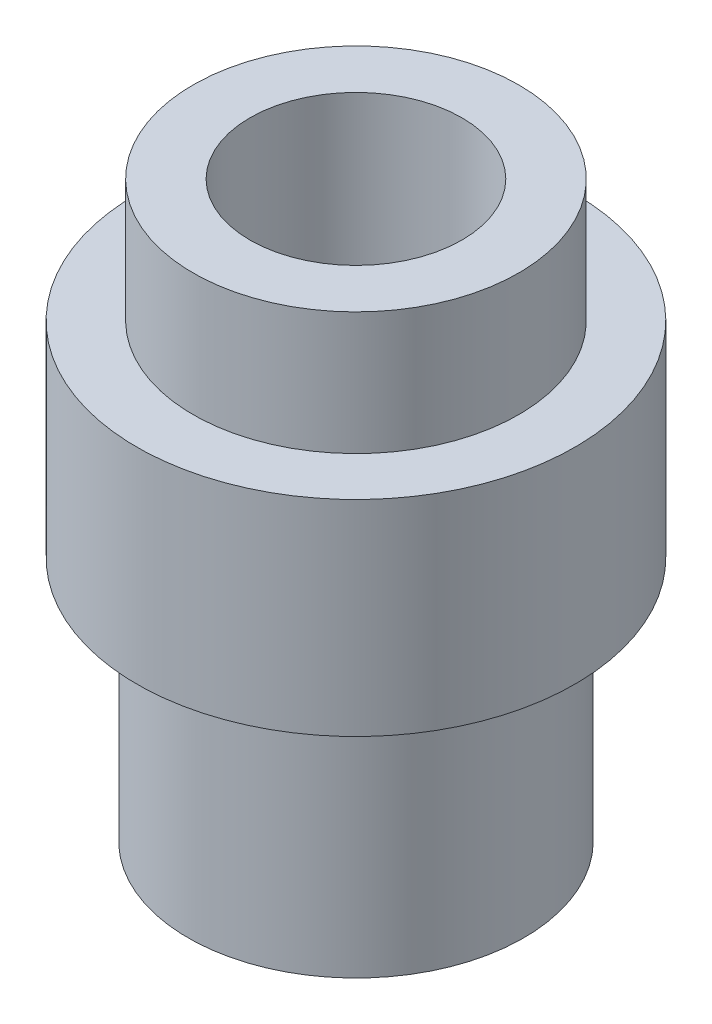
ISO-10303-21;
HEADER;
FILE_DESCRIPTION(('STEP AP214'),'2;1');
FILE_NAME('part.step','',(''),(''),'','','');
FILE_SCHEMA(('AUTOMOTIVE_DESIGN { 1 0 10303 214 1 1 1 1 }'));
ENDSEC;
DATA;
#1=APPLICATION_CONTEXT('core data for automotive mechanical design processes');
#2=APPLICATION_PROTOCOL_DEFINITION('international standard','automotive_design',2000,#1);
#3=PRODUCT_CONTEXT('',#1,'mechanical');
#4=PRODUCT('Part','Part','',(#3));
#5=PRODUCT_RELATED_PRODUCT_CATEGORY('part','',(#4));
#6=PRODUCT_DEFINITION_FORMATION('','',#4);
#7=PRODUCT_DEFINITION_CONTEXT('part definition',#1,'design');
#8=PRODUCT_DEFINITION('design','',#6,#7);
#9=PRODUCT_DEFINITION_SHAPE('','',#8);
#10=(LENGTH_UNIT() NAMED_UNIT(*) SI_UNIT(.MILLI.,.METRE.));
#11=(NAMED_UNIT(*) PLANE_ANGLE_UNIT() SI_UNIT($,.RADIAN.));
#12=(NAMED_UNIT(*) SI_UNIT($,.STERADIAN.) SOLID_ANGLE_UNIT());
#13=UNCERTAINTY_MEASURE_WITH_UNIT(LENGTH_MEASURE(1.E-05),#10,'distance_accuracy_value','');
#14=(GEOMETRIC_REPRESENTATION_CONTEXT(3) GLOBAL_UNCERTAINTY_ASSIGNED_CONTEXT((#13)) GLOBAL_UNIT_ASSIGNED_CONTEXT((#10,
#11,#12)) REPRESENTATION_CONTEXT('',''));
#15=CARTESIAN_POINT('',(0.,0.,0.));
#16=DIRECTION('',(0.,0.,1.));
#17=DIRECTION('',(1.,0.,0.));
#18=AXIS2_PLACEMENT_3D('',#15,#16,#17);
#19=CARTESIAN_POINT('',(3.76014538790642,0.,0.));
#20=DIRECTION('',(0.,-1.,0.));
#21=DIRECTION('',(0.,0.,-1.));
#22=AXIS2_PLACEMENT_3D('',#19,#20,#21);
#23=PLANE('',#22);
#24=CARTESIAN_POINT('',(0.,0.,0.));
#25=DIRECTION('',(0.,-1.,0.));
#26=DIRECTION('',(0.,0.,-1.));
#27=AXIS2_PLACEMENT_3D('',#24,#25,#26);
#28=CIRCLE('',#27,3.76014538790642);
#29=CARTESIAN_POINT('',(0.,0.,-3.76014538790642));
#30=VERTEX_POINT('',#29);
#31=EDGE_CURVE('E11',#30,#30,#28,.T.);
#32=ORIENTED_EDGE('',*,*,#31,.T.);
#33=EDGE_LOOP('',(#32));
#34=FACE_BOUND('',#33,.T.);
#35=ADVANCED_FACE('F47',(#34),#23,.T.);
#36=CARTESIAN_POINT('',(0.,0.,0.));
#37=DIRECTION('',(0.,-1.,0.));
#38=DIRECTION('',(0.,0.,-1.));
#39=AXIS2_PLACEMENT_3D('',#36,#37,#38);
#40=CYLINDRICAL_SURFACE('',#39,3.76014538790642);
#41=CARTESIAN_POINT('',(0.,5.5,0.));
#42=DIRECTION('',(0.,-1.,0.));
#43=DIRECTION('',(0.,0.,-1.));
#44=AXIS2_PLACEMENT_3D('',#41,#42,#43);
#45=CIRCLE('',#44,3.76014538790642);
#46=CARTESIAN_POINT('',(0.,5.5,-3.76014538790642));
#47=VERTEX_POINT('',#46);
#48=EDGE_CURVE('E54',#47,#47,#45,.T.);
#49=ORIENTED_EDGE('',*,*,#48,.T.);
#50=EDGE_LOOP('',(#49));
#51=FACE_BOUND('',#50,.T.);
#52=ORIENTED_EDGE('',*,*,#31,.F.);
#53=EDGE_LOOP('',(#52));
#54=FACE_BOUND('',#53,.T.);
#55=ADVANCED_FACE('F92',(#51,#54),#40,.T.);
#56=CARTESIAN_POINT('',(3.76014538790642,5.5,0.));
#57=DIRECTION('',(0.,-1.,0.));
#58=DIRECTION('',(0.,0.,-1.));
#59=AXIS2_PLACEMENT_3D('',#56,#57,#58);
#60=PLANE('',#59);
#61=CARTESIAN_POINT('',(0.,5.5,0.));
#62=DIRECTION('',(0.,-1.,0.));
#63=DIRECTION('',(0.,0.,-1.));
#64=AXIS2_PLACEMENT_3D('',#61,#62,#63);
#65=CIRCLE('',#64,4.90999999999999);
#66=CARTESIAN_POINT('',(0.,5.5,-4.90999999999999));
#67=VERTEX_POINT('',#66);
#68=EDGE_CURVE('E85',#67,#67,#65,.T.);
#69=ORIENTED_EDGE('',*,*,#68,.T.);
#70=EDGE_LOOP('',(#69));
#71=FACE_BOUND('',#70,.T.);
#72=ORIENTED_EDGE('',*,*,#48,.F.);
#73=EDGE_LOOP('',(#72));
#74=FACE_BOUND('',#73,.T.);
#75=ADVANCED_FACE('F95',(#71,#74),#60,.T.);
#76=CARTESIAN_POINT('',(0.,0.,0.));
#77=DIRECTION('',(0.,-1.,0.));
#78=DIRECTION('',(0.,0.,-1.));
#79=AXIS2_PLACEMENT_3D('',#76,#77,#78);
#80=CYLINDRICAL_SURFACE('',#79,4.90999999999999);
#81=CARTESIAN_POINT('',(0.,10.1,0.));
#82=DIRECTION('',(0.,-1.,0.));
#83=DIRECTION('',(0.,0.,-1.));
#84=AXIS2_PLACEMENT_3D('',#81,#82,#83);
#85=CIRCLE('',#84,4.90999999999999);
#86=CARTESIAN_POINT('',(0.,10.1,-4.90999999999999));
#87=VERTEX_POINT('',#86);
#88=EDGE_CURVE('E81',#87,#87,#85,.T.);
#89=ORIENTED_EDGE('',*,*,#88,.T.);
#90=EDGE_LOOP('',(#89));
#91=FACE_BOUND('',#90,.T.);
#92=ORIENTED_EDGE('',*,*,#68,.F.);
#93=EDGE_LOOP('',(#92));
#94=FACE_BOUND('',#93,.T.);
#95=ADVANCED_FACE('F97',(#91,#94),#80,.T.);
#96=CARTESIAN_POINT('',(4.90999999999999,10.1,0.));
#97=DIRECTION('',(0.,1.,0.));
#98=DIRECTION('',(0.,0.,1.));
#99=AXIS2_PLACEMENT_3D('',#96,#97,#98);
#100=PLANE('',#99);
#101=CARTESIAN_POINT('',(0.,10.1,0.));
#102=DIRECTION('',(0.,-1.,0.));
#103=DIRECTION('',(0.,0.,-1.));
#104=AXIS2_PLACEMENT_3D('',#101,#102,#103);
#105=CIRCLE('',#104,3.65);
#106=CARTESIAN_POINT('',(0.,10.1,-3.65));
#107=VERTEX_POINT('',#106);
#108=EDGE_CURVE('E78',#107,#107,#105,.T.);
#109=ORIENTED_EDGE('',*,*,#108,.T.);
#110=EDGE_LOOP('',(#109));
#111=FACE_BOUND('',#110,.T.);
#112=ORIENTED_EDGE('',*,*,#88,.F.);
#113=EDGE_LOOP('',(#112));
#114=FACE_BOUND('',#113,.T.);
#115=ADVANCED_FACE('F103',(#111,#114),#100,.T.);
#116=CARTESIAN_POINT('',(0.,0.,0.));
#117=DIRECTION('',(0.,-1.,0.));
#118=DIRECTION('',(0.,0.,-1.));
#119=AXIS2_PLACEMENT_3D('',#116,#117,#118);
#120=CYLINDRICAL_SURFACE('',#119,3.65);
#121=CARTESIAN_POINT('',(0.,12.85,0.));
#122=DIRECTION('',(0.,-1.,0.));
#123=DIRECTION('',(0.,0.,-1.));
#124=AXIS2_PLACEMENT_3D('',#121,#122,#123);
#125=CIRCLE('',#124,3.65);
#126=CARTESIAN_POINT('',(0.,12.85,-3.65));
#127=VERTEX_POINT('',#126);
#128=EDGE_CURVE('E72',#127,#127,#125,.T.);
#129=ORIENTED_EDGE('',*,*,#128,.T.);
#130=EDGE_LOOP('',(#129));
#131=FACE_BOUND('',#130,.T.);
#132=ORIENTED_EDGE('',*,*,#108,.F.);
#133=EDGE_LOOP('',(#132));
#134=FACE_BOUND('',#133,.T.);
#135=ADVANCED_FACE('F134',(#131,#134),#120,.T.);
#136=CARTESIAN_POINT('',(2.375,12.85,0.));
#137=DIRECTION('',(0.,1.,0.));
#138=DIRECTION('',(0.,0.,1.));
#139=AXIS2_PLACEMENT_3D('',#136,#137,#138);
#140=PLANE('',#139);
#141=CARTESIAN_POINT('',(0.,12.85,0.));
#142=DIRECTION('',(0.,-1.,0.));
#143=DIRECTION('',(0.,0.,-1.));
#144=AXIS2_PLACEMENT_3D('',#141,#142,#143);
#145=CIRCLE('',#144,2.375);
#146=CARTESIAN_POINT('',(0.,12.85,-2.375));
#147=VERTEX_POINT('',#146);
#148=EDGE_CURVE('E67',#147,#147,#145,.T.);
#149=ORIENTED_EDGE('',*,*,#148,.T.);
#150=EDGE_LOOP('',(#149));
#151=FACE_BOUND('',#150,.T.);
#152=ORIENTED_EDGE('',*,*,#128,.F.);
#153=EDGE_LOOP('',(#152));
#154=FACE_BOUND('',#153,.T.);
#155=ADVANCED_FACE('F144',(#151,#154),#140,.T.);
#156=CARTESIAN_POINT('',(0.,0.,0.));
#157=DIRECTION('',(0.,-1.,0.));
#158=DIRECTION('',(0.,0.,-1.));
#159=AXIS2_PLACEMENT_3D('',#156,#157,#158);
#160=CYLINDRICAL_SURFACE('',#159,2.375);
#161=CARTESIAN_POINT('',(0.,3.42704397019047,0.));
#162=DIRECTION('',(0.,-1.,0.));
#163=DIRECTION('',(0.,0.,-1.));
#164=AXIS2_PLACEMENT_3D('',#161,#162,#163);
#165=CIRCLE('',#164,2.375);
#166=CARTESIAN_POINT('',(0.,3.42704397019047,-2.375));
#167=VERTEX_POINT('',#166);
#168=EDGE_CURVE('E64',#167,#167,#165,.T.);
#169=ORIENTED_EDGE('',*,*,#168,.T.);
#170=EDGE_LOOP('',(#169));
#171=FACE_BOUND('',#170,.T.);
#172=ORIENTED_EDGE('',*,*,#148,.F.);
#173=EDGE_LOOP('',(#172));
#174=FACE_BOUND('',#173,.T.);
#175=ADVANCED_FACE('F60',(#171,#174),#160,.F.);
#176=CARTESIAN_POINT('',(0.,3.42704397019047,0.));
#177=DIRECTION('',(0.,1.,0.));
#178=DIRECTION('',(0.,0.,1.));
#179=AXIS2_PLACEMENT_3D('',#176,#177,#178);
#180=CONICAL_SURFACE('',#179,2.375,1.02974425867665);
#181=CARTESIAN_POINT('',(0.,2.,0.));
#182=VERTEX_POINT('',#181);
#183=VERTEX_LOOP('',#182);
#184=FACE_BOUND('',#183,.T.);
#185=ORIENTED_EDGE('',*,*,#168,.F.);
#186=EDGE_LOOP('',(#185));
#187=FACE_BOUND('',#186,.T.);
#188=ADVANCED_FACE('F57',(#184,#187),#180,.F.);
#189=CLOSED_SHELL('',(#35,#55,#75,#95,#115,#135,#155,#175,#188));
#190=MANIFOLD_SOLID_BREP('B2',#189);
#191=ADVANCED_BREP_SHAPE_REPRESENTATION('',(#18,#190),#14);
#192=SHAPE_DEFINITION_REPRESENTATION(#9,#191);
ENDSEC;
END-ISO-10303-21;
